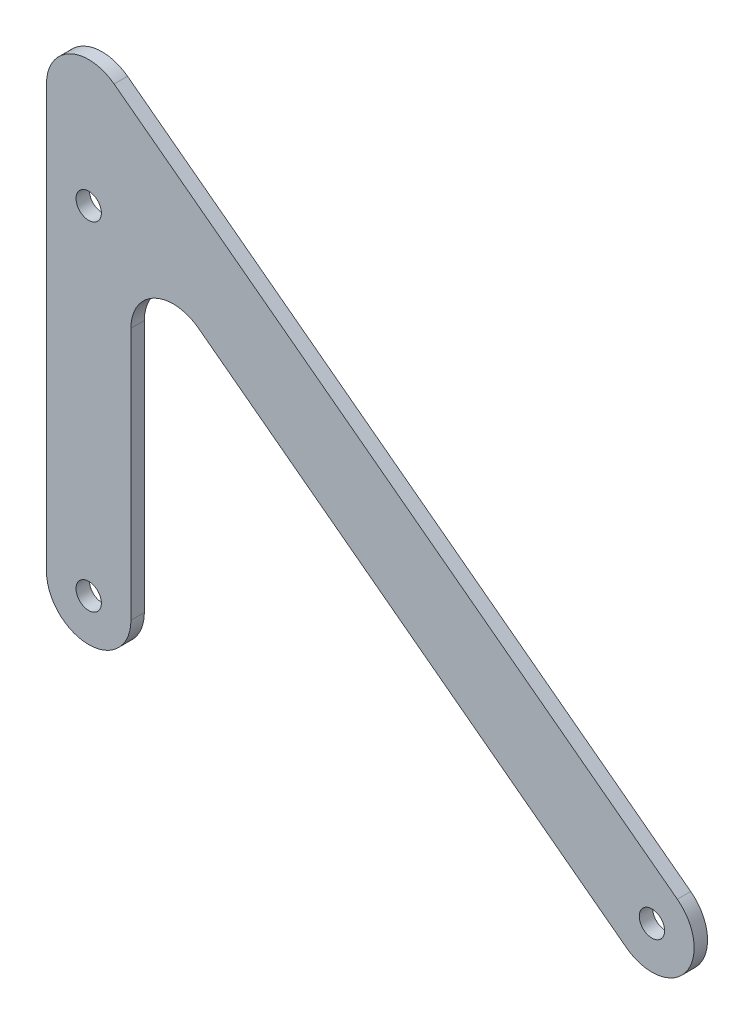
ISO-10303-21;
HEADER;
FILE_DESCRIPTION(('STEP AP214'),'2;1');
FILE_NAME('part.step','',(''),(''),'','','');
FILE_SCHEMA(('AUTOMOTIVE_DESIGN { 1 0 10303 214 1 1 1 1 }'));
ENDSEC;
DATA;
#1=APPLICATION_CONTEXT('core data for automotive mechanical design processes');
#2=APPLICATION_PROTOCOL_DEFINITION('international standard','automotive_design',2000,#1);
#3=PRODUCT_CONTEXT('',#1,'mechanical');
#4=PRODUCT('Part','Part','',(#3));
#5=PRODUCT_RELATED_PRODUCT_CATEGORY('part','',(#4));
#6=PRODUCT_DEFINITION_FORMATION('','',#4);
#7=PRODUCT_DEFINITION_CONTEXT('part definition',#1,'design');
#8=PRODUCT_DEFINITION('design','',#6,#7);
#9=PRODUCT_DEFINITION_SHAPE('','',#8);
#10=(LENGTH_UNIT() NAMED_UNIT(*) SI_UNIT(.MILLI.,.METRE.));
#11=(NAMED_UNIT(*) PLANE_ANGLE_UNIT() SI_UNIT($,.RADIAN.));
#12=(NAMED_UNIT(*) SI_UNIT($,.STERADIAN.) SOLID_ANGLE_UNIT());
#13=UNCERTAINTY_MEASURE_WITH_UNIT(LENGTH_MEASURE(1.E-05),#10,'distance_accuracy_value','');
#14=(GEOMETRIC_REPRESENTATION_CONTEXT(3) GLOBAL_UNCERTAINTY_ASSIGNED_CONTEXT((#13)) GLOBAL_UNIT_ASSIGNED_CONTEXT((#10,
#11,#12)) REPRESENTATION_CONTEXT('',''));
#15=CARTESIAN_POINT('',(0.,0.,0.));
#16=DIRECTION('',(0.,0.,1.));
#17=DIRECTION('',(1.,0.,0.));
#18=AXIS2_PLACEMENT_3D('',#15,#16,#17);
#19=CARTESIAN_POINT('',(0.,0.,3.175));
#20=DIRECTION('',(0.,0.,-1.));
#21=DIRECTION('',(-1.,0.,0.));
#22=AXIS2_PLACEMENT_3D('',#19,#20,#21);
#23=PLANE('',#22);
#24=CARTESIAN_POINT('',(0.,80.,3.175));
#25=DIRECTION('',(0.,0.,1.));
#26=DIRECTION('',(1.,0.,0.));
#27=AXIS2_PLACEMENT_3D('',#24,#25,#26);
#28=CIRCLE('',#27,3.);
#29=CARTESIAN_POINT('',(3.,80.,3.175));
#30=VERTEX_POINT('',#29);
#31=EDGE_CURVE('E223',#30,#30,#28,.T.);
#32=ORIENTED_EDGE('',*,*,#31,.F.);
#33=EDGE_LOOP('',(#32));
#34=FACE_BOUND('',#33,.T.);
#35=DIRECTION('',(-0.79863551004729,0.601815023152052,0.));
#36=VECTOR('',#35,1.);
#37=CARTESIAN_POINT('',(-10.,120.05689708259,3.175));
#38=LINE('',#37,#36);
#39=CARTESIAN_POINT('',(139.390280409418,7.48324623408012,3.175));
#40=VERTEX_POINT('',#39);
#41=CARTESIAN_POINT('',(6.01815023152051,107.986355100473,3.175));
#42=VERTEX_POINT('',#41);
#43=EDGE_CURVE('E164',#40,#42,#38,.T.);
#44=ORIENTED_EDGE('',*,*,#43,.T.);
#45=CARTESIAN_POINT('',(0.,100.,3.175));
#46=DIRECTION('',(0.,0.,-1.));
#47=DIRECTION('',(-1.,0.,0.));
#48=AXIS2_PLACEMENT_3D('',#45,#46,#47);
#49=CIRCLE('',#48,10.);
#50=CARTESIAN_POINT('',(-10.,100.,3.175));
#51=VERTEX_POINT('',#50);
#52=EDGE_CURVE('E146',#42,#51,#49,.F.);
#53=ORIENTED_EDGE('',*,*,#52,.T.);
#54=DIRECTION('',(0.,-1.,0.));
#55=VECTOR('',#54,1.);
#56=CARTESIAN_POINT('',(-10.,0.,3.175));
#57=LINE('',#56,#55);
#58=CARTESIAN_POINT('',(-10.,0.,3.175));
#59=VERTEX_POINT('',#58);
#60=EDGE_CURVE('E121',#51,#59,#57,.T.);
#61=ORIENTED_EDGE('',*,*,#60,.T.);
#62=CARTESIAN_POINT('',(0.,0.,3.175));
#63=DIRECTION('',(0.,0.,1.));
#64=DIRECTION('',(-1.,0.,0.));
#65=AXIS2_PLACEMENT_3D('',#62,#63,#64);
#66=CIRCLE('',#65,10.);
#67=CARTESIAN_POINT('',(10.,0.,3.175));
#68=VERTEX_POINT('',#67);
#69=EDGE_CURVE('E116',#59,#68,#66,.T.);
#70=ORIENTED_EDGE('',*,*,#69,.T.);
#71=DIRECTION('',(0.,1.,0.));
#72=VECTOR('',#71,1.);
#73=CARTESIAN_POINT('',(10.,0.,3.175));
#74=LINE('',#73,#72);
#75=CARTESIAN_POINT('',(10.,59.8862058348193,3.175));
#76=VERTEX_POINT('',#75);
#77=EDGE_CURVE('E104',#68,#76,#74,.T.);
#78=ORIENTED_EDGE('',*,*,#77,.T.);
#79=CARTESIAN_POINT('',(20.,59.8862058348194,3.175));
#80=DIRECTION('',(0.,0.,-1.));
#81=DIRECTION('',(-1.,0.,0.));
#82=AXIS2_PLACEMENT_3D('',#79,#80,#81);
#83=CIRCLE('',#82,10.);
#84=CARTESIAN_POINT('',(26.0181502315205,67.8725609352922,3.175));
#85=VERTEX_POINT('',#84);
#86=EDGE_CURVE('E11',#76,#85,#83,.T.);
#87=ORIENTED_EDGE('',*,*,#86,.T.);
#88=DIRECTION('',(0.79863551004729,-0.601815023152052,0.));
#89=VECTOR('',#88,1.);
#90=CARTESIAN_POINT('',(10.,79.9431029174097,3.175));
#91=LINE('',#90,#89);
#92=CARTESIAN_POINT('',(127.353979946377,-8.48946396686568,3.175));
#93=VERTEX_POINT('',#92);
#94=EDGE_CURVE('E115',#85,#93,#91,.T.);
#95=ORIENTED_EDGE('',*,*,#94,.T.);
#96=CARTESIAN_POINT('',(133.372130177897,-0.503108866392774,3.175));
#97=DIRECTION('',(0.,0.,1.));
#98=DIRECTION('',(-1.,0.,0.));
#99=AXIS2_PLACEMENT_3D('',#96,#97,#98);
#100=CIRCLE('',#99,10.);
#101=EDGE_CURVE('E162',#93,#40,#100,.T.);
#102=ORIENTED_EDGE('',*,*,#101,.T.);
#103=EDGE_LOOP('',(#44,#53,#61,#70,#78,#87,#95,#102));
#104=FACE_BOUND('',#103,.T.);
#105=CARTESIAN_POINT('',(0.,0.,3.175));
#106=DIRECTION('',(0.,0.,1.));
#107=DIRECTION('',(1.,0.,0.));
#108=AXIS2_PLACEMENT_3D('',#105,#106,#107);
#109=CIRCLE('',#108,3.);
#110=CARTESIAN_POINT('',(3.,0.,3.175));
#111=VERTEX_POINT('',#110);
#112=EDGE_CURVE('E170',#111,#111,#109,.T.);
#113=ORIENTED_EDGE('',*,*,#112,.F.);
#114=EDGE_LOOP('',(#113));
#115=FACE_BOUND('',#114,.T.);
#116=CARTESIAN_POINT('',(133.372130177897,-0.503108866392774,3.175));
#117=DIRECTION('',(0.,0.,1.));
#118=DIRECTION('',(1.,0.,0.));
#119=AXIS2_PLACEMENT_3D('',#116,#117,#118);
#120=CIRCLE('',#119,2.99999999999999);
#121=CARTESIAN_POINT('',(136.372130177897,-0.503108866392774,3.175));
#122=VERTEX_POINT('',#121);
#123=EDGE_CURVE('E228',#122,#122,#120,.T.);
#124=ORIENTED_EDGE('',*,*,#123,.F.);
#125=EDGE_LOOP('',(#124));
#126=FACE_BOUND('',#125,.T.);
#127=ADVANCED_FACE('F38',(#34,#104,#115,#126),#23,.F.);
#128=CARTESIAN_POINT('',(0.,0.,0.));
#129=DIRECTION('',(0.,0.,-1.));
#130=DIRECTION('',(-1.,0.,0.));
#131=AXIS2_PLACEMENT_3D('',#128,#129,#130);
#132=PLANE('',#131);
#133=CARTESIAN_POINT('',(0.,80.,0.));
#134=DIRECTION('',(0.,0.,1.));
#135=DIRECTION('',(1.,0.,0.));
#136=AXIS2_PLACEMENT_3D('',#133,#134,#135);
#137=CIRCLE('',#136,3.);
#138=CARTESIAN_POINT('',(3.,80.,0.));
#139=VERTEX_POINT('',#138);
#140=EDGE_CURVE('E221',#139,#139,#137,.T.);
#141=ORIENTED_EDGE('',*,*,#140,.T.);
#142=EDGE_LOOP('',(#141));
#143=FACE_BOUND('',#142,.T.);
#144=CARTESIAN_POINT('',(0.,0.,0.));
#145=DIRECTION('',(0.,0.,1.));
#146=DIRECTION('',(1.,0.,0.));
#147=AXIS2_PLACEMENT_3D('',#144,#145,#146);
#148=CIRCLE('',#147,3.);
#149=CARTESIAN_POINT('',(3.,0.,0.));
#150=VERTEX_POINT('',#149);
#151=EDGE_CURVE('E231',#150,#150,#148,.T.);
#152=ORIENTED_EDGE('',*,*,#151,.T.);
#153=EDGE_LOOP('',(#152));
#154=FACE_BOUND('',#153,.T.);
#155=DIRECTION('',(0.,-1.,0.));
#156=VECTOR('',#155,1.);
#157=CARTESIAN_POINT('',(-10.,0.,0.));
#158=LINE('',#157,#156);
#159=CARTESIAN_POINT('',(-10.,100.,0.));
#160=VERTEX_POINT('',#159);
#161=CARTESIAN_POINT('',(-10.,0.,0.));
#162=VERTEX_POINT('',#161);
#163=EDGE_CURVE('E125',#160,#162,#158,.T.);
#164=ORIENTED_EDGE('',*,*,#163,.F.);
#165=CARTESIAN_POINT('',(0.,100.,0.));
#166=DIRECTION('',(0.,0.,-1.));
#167=DIRECTION('',(-1.,0.,0.));
#168=AXIS2_PLACEMENT_3D('',#165,#166,#167);
#169=CIRCLE('',#168,10.);
#170=CARTESIAN_POINT('',(6.01815023152051,107.986355100473,0.));
#171=VERTEX_POINT('',#170);
#172=EDGE_CURVE('E61',#160,#171,#169,.T.);
#173=ORIENTED_EDGE('',*,*,#172,.T.);
#174=DIRECTION('',(-0.79863551004729,0.601815023152052,0.));
#175=VECTOR('',#174,1.);
#176=CARTESIAN_POINT('',(-10.,120.05689708259,0.));
#177=LINE('',#176,#175);
#178=CARTESIAN_POINT('',(139.390280409418,7.48324623408012,0.));
#179=VERTEX_POINT('',#178);
#180=EDGE_CURVE('E175',#179,#171,#177,.T.);
#181=ORIENTED_EDGE('',*,*,#180,.F.);
#182=CARTESIAN_POINT('',(133.372130177897,-0.503108866392774,0.));
#183=DIRECTION('',(0.,0.,1.));
#184=DIRECTION('',(-1.,0.,0.));
#185=AXIS2_PLACEMENT_3D('',#182,#183,#184);
#186=CIRCLE('',#185,10.);
#187=CARTESIAN_POINT('',(127.353979946377,-8.48946396686568,0.));
#188=VERTEX_POINT('',#187);
#189=EDGE_CURVE('E173',#188,#179,#186,.T.);
#190=ORIENTED_EDGE('',*,*,#189,.F.);
#191=DIRECTION('',(0.79863551004729,-0.601815023152052,0.));
#192=VECTOR('',#191,1.);
#193=CARTESIAN_POINT('',(10.,79.9431029174097,0.));
#194=LINE('',#193,#192);
#195=CARTESIAN_POINT('',(26.0181502315205,67.8725609352922,0.));
#196=VERTEX_POINT('',#195);
#197=EDGE_CURVE('E152',#196,#188,#194,.T.);
#198=ORIENTED_EDGE('',*,*,#197,.F.);
#199=CARTESIAN_POINT('',(20.,59.8862058348194,0.));
#200=DIRECTION('',(0.,0.,-1.));
#201=DIRECTION('',(-1.,0.,0.));
#202=AXIS2_PLACEMENT_3D('',#199,#200,#201);
#203=CIRCLE('',#202,10.);
#204=CARTESIAN_POINT('',(10.,59.8862058348193,0.));
#205=VERTEX_POINT('',#204);
#206=EDGE_CURVE('E46',#196,#205,#203,.F.);
#207=ORIENTED_EDGE('',*,*,#206,.T.);
#208=DIRECTION('',(0.,1.,0.));
#209=VECTOR('',#208,1.);
#210=CARTESIAN_POINT('',(10.,0.,0.));
#211=LINE('',#210,#209);
#212=CARTESIAN_POINT('',(10.,0.,0.));
#213=VERTEX_POINT('',#212);
#214=EDGE_CURVE('E150',#213,#205,#211,.T.);
#215=ORIENTED_EDGE('',*,*,#214,.F.);
#216=CARTESIAN_POINT('',(0.,0.,0.));
#217=DIRECTION('',(0.,0.,1.));
#218=DIRECTION('',(-1.,0.,0.));
#219=AXIS2_PLACEMENT_3D('',#216,#217,#218);
#220=CIRCLE('',#219,10.);
#221=EDGE_CURVE('E129',#162,#213,#220,.T.);
#222=ORIENTED_EDGE('',*,*,#221,.F.);
#223=EDGE_LOOP('',(#164,#173,#181,#190,#198,#207,#215,#222));
#224=FACE_BOUND('',#223,.T.);
#225=CARTESIAN_POINT('',(133.372130177897,-0.503108866392774,0.));
#226=DIRECTION('',(0.,0.,1.));
#227=DIRECTION('',(1.,0.,0.));
#228=AXIS2_PLACEMENT_3D('',#225,#226,#227);
#229=CIRCLE('',#228,2.99999999999999);
#230=CARTESIAN_POINT('',(136.372130177897,-0.503108866392774,0.));
#231=VERTEX_POINT('',#230);
#232=EDGE_CURVE('E225',#231,#231,#229,.T.);
#233=ORIENTED_EDGE('',*,*,#232,.T.);
#234=EDGE_LOOP('',(#233));
#235=FACE_BOUND('',#234,.T.);
#236=ADVANCED_FACE('F148',(#143,#154,#224,#235),#132,.T.);
#237=CARTESIAN_POINT('',(0.,0.,3.175));
#238=DIRECTION('',(0.,0.,-1.));
#239=DIRECTION('',(-1.,0.,0.));
#240=AXIS2_PLACEMENT_3D('',#237,#238,#239);
#241=CYLINDRICAL_SURFACE('',#240,10.);
#242=ORIENTED_EDGE('',*,*,#221,.T.);
#243=DIRECTION('',(0.,0.,-1.));
#244=VECTOR('',#243,1.);
#245=CARTESIAN_POINT('',(10.,0.,3.175));
#246=LINE('',#245,#244);
#247=EDGE_CURVE('E109',#68,#213,#246,.T.);
#248=ORIENTED_EDGE('',*,*,#247,.F.);
#249=ORIENTED_EDGE('',*,*,#69,.F.);
#250=DIRECTION('',(0.,0.,-1.));
#251=VECTOR('',#250,1.);
#252=CARTESIAN_POINT('',(-10.,0.,3.175));
#253=LINE('',#252,#251);
#254=EDGE_CURVE('E169',#59,#162,#253,.T.);
#255=ORIENTED_EDGE('',*,*,#254,.T.);
#256=EDGE_LOOP('',(#242,#248,#249,#255));
#257=FACE_BOUND('',#256,.T.);
#258=ADVANCED_FACE('F127',(#257),#241,.T.);
#259=CARTESIAN_POINT('',(10.,0.,3.175));
#260=DIRECTION('',(-1.,0.,0.));
#261=DIRECTION('',(0.,-1.,0.));
#262=AXIS2_PLACEMENT_3D('',#259,#260,#261);
#263=PLANE('',#262);
#264=ORIENTED_EDGE('',*,*,#214,.T.);
#265=DIRECTION('',(0.,0.,-1.));
#266=VECTOR('',#265,1.);
#267=CARTESIAN_POINT('',(10.,59.8862058348194,3.175));
#268=LINE('',#267,#266);
#269=EDGE_CURVE('E112',#205,#76,#268,.F.);
#270=ORIENTED_EDGE('',*,*,#269,.T.);
#271=ORIENTED_EDGE('',*,*,#77,.F.);
#272=ORIENTED_EDGE('',*,*,#247,.T.);
#273=EDGE_LOOP('',(#264,#270,#271,#272));
#274=FACE_BOUND('',#273,.T.);
#275=ADVANCED_FACE('F107',(#274),#263,.F.);
#276=CARTESIAN_POINT('',(10.,79.9431029174097,3.175));
#277=DIRECTION('',(0.601815023152052,0.79863551004729,0.));
#278=DIRECTION('',(-0.79863551004729,0.601815023152052,0.));
#279=AXIS2_PLACEMENT_3D('',#276,#277,#278);
#280=PLANE('',#279);
#281=ORIENTED_EDGE('',*,*,#94,.F.);
#282=DIRECTION('',(0.,0.,-1.));
#283=VECTOR('',#282,1.);
#284=CARTESIAN_POINT('',(26.0181502315205,67.8725609352922,0.));
#285=LINE('',#284,#283);
#286=EDGE_CURVE('E130',#85,#196,#285,.T.);
#287=ORIENTED_EDGE('',*,*,#286,.T.);
#288=ORIENTED_EDGE('',*,*,#197,.T.);
#289=DIRECTION('',(0.,0.,-1.));
#290=VECTOR('',#289,1.);
#291=CARTESIAN_POINT('',(127.353979946377,-8.48946396686568,3.175));
#292=LINE('',#291,#290);
#293=EDGE_CURVE('E131',#93,#188,#292,.T.);
#294=ORIENTED_EDGE('',*,*,#293,.F.);
#295=EDGE_LOOP('',(#281,#287,#288,#294));
#296=FACE_BOUND('',#295,.T.);
#297=ADVANCED_FACE('F160',(#296),#280,.F.);
#298=CARTESIAN_POINT('',(133.372130177897,-0.503108866392774,3.175));
#299=DIRECTION('',(0.,0.,-1.));
#300=DIRECTION('',(-1.,0.,0.));
#301=AXIS2_PLACEMENT_3D('',#298,#299,#300);
#302=CYLINDRICAL_SURFACE('',#301,10.);
#303=ORIENTED_EDGE('',*,*,#189,.T.);
#304=DIRECTION('',(0.,0.,-1.));
#305=VECTOR('',#304,1.);
#306=CARTESIAN_POINT('',(139.390280409418,7.48324623408012,3.175));
#307=LINE('',#306,#305);
#308=EDGE_CURVE('E136',#40,#179,#307,.T.);
#309=ORIENTED_EDGE('',*,*,#308,.F.);
#310=ORIENTED_EDGE('',*,*,#101,.F.);
#311=ORIENTED_EDGE('',*,*,#293,.T.);
#312=EDGE_LOOP('',(#303,#309,#310,#311));
#313=FACE_BOUND('',#312,.T.);
#314=ADVANCED_FACE('F182',(#313),#302,.T.);
#315=CARTESIAN_POINT('',(-10.,120.05689708259,3.175));
#316=DIRECTION('',(-0.601815023152052,-0.79863551004729,0.));
#317=DIRECTION('',(0.79863551004729,-0.601815023152052,0.));
#318=AXIS2_PLACEMENT_3D('',#315,#316,#317);
#319=PLANE('',#318);
#320=ORIENTED_EDGE('',*,*,#180,.T.);
#321=DIRECTION('',(0.,0.,-1.));
#322=VECTOR('',#321,1.);
#323=CARTESIAN_POINT('',(6.01815023152051,107.986355100473,3.175));
#324=LINE('',#323,#322);
#325=EDGE_CURVE('E53',#171,#42,#324,.F.);
#326=ORIENTED_EDGE('',*,*,#325,.T.);
#327=ORIENTED_EDGE('',*,*,#43,.F.);
#328=ORIENTED_EDGE('',*,*,#308,.T.);
#329=EDGE_LOOP('',(#320,#326,#327,#328));
#330=FACE_BOUND('',#329,.T.);
#331=ADVANCED_FACE('F180',(#330),#319,.F.);
#332=CARTESIAN_POINT('',(-10.,0.,3.175));
#333=DIRECTION('',(1.,0.,0.));
#334=DIRECTION('',(0.,1.,0.));
#335=AXIS2_PLACEMENT_3D('',#332,#333,#334);
#336=PLANE('',#335);
#337=ORIENTED_EDGE('',*,*,#60,.F.);
#338=DIRECTION('',(0.,0.,-1.));
#339=VECTOR('',#338,1.);
#340=CARTESIAN_POINT('',(-10.,100.,3.175));
#341=LINE('',#340,#339);
#342=EDGE_CURVE('E141',#51,#160,#341,.T.);
#343=ORIENTED_EDGE('',*,*,#342,.T.);
#344=ORIENTED_EDGE('',*,*,#163,.T.);
#345=ORIENTED_EDGE('',*,*,#254,.F.);
#346=EDGE_LOOP('',(#337,#343,#344,#345));
#347=FACE_BOUND('',#346,.T.);
#348=ADVANCED_FACE('F187',(#347),#336,.F.);
#349=CARTESIAN_POINT('',(0.,0.,3.175));
#350=DIRECTION('',(0.,0.,-1.));
#351=DIRECTION('',(-1.,0.,0.));
#352=AXIS2_PLACEMENT_3D('',#349,#350,#351);
#353=CYLINDRICAL_SURFACE('',#352,3.);
#354=ORIENTED_EDGE('',*,*,#112,.T.);
#355=EDGE_LOOP('',(#354));
#356=FACE_BOUND('',#355,.T.);
#357=ORIENTED_EDGE('',*,*,#151,.F.);
#358=EDGE_LOOP('',(#357));
#359=FACE_BOUND('',#358,.T.);
#360=ADVANCED_FACE('F189',(#356,#359),#353,.F.);
#361=CARTESIAN_POINT('',(133.372130177897,-0.503108866392774,3.175));
#362=DIRECTION('',(0.,0.,-1.));
#363=DIRECTION('',(-1.,0.,0.));
#364=AXIS2_PLACEMENT_3D('',#361,#362,#363);
#365=CYLINDRICAL_SURFACE('',#364,2.99999999999999);
#366=ORIENTED_EDGE('',*,*,#123,.T.);
#367=EDGE_LOOP('',(#366));
#368=FACE_BOUND('',#367,.T.);
#369=ORIENTED_EDGE('',*,*,#232,.F.);
#370=EDGE_LOOP('',(#369));
#371=FACE_BOUND('',#370,.T.);
#372=ADVANCED_FACE('F195',(#368,#371),#365,.F.);
#373=CARTESIAN_POINT('',(20.,59.8862058348194,3.175));
#374=DIRECTION('',(0.,0.,1.));
#375=DIRECTION('',(1.,0.,0.));
#376=AXIS2_PLACEMENT_3D('',#373,#374,#375);
#377=CYLINDRICAL_SURFACE('',#376,10.);
#378=ORIENTED_EDGE('',*,*,#86,.F.);
#379=ORIENTED_EDGE('',*,*,#269,.F.);
#380=ORIENTED_EDGE('',*,*,#206,.F.);
#381=ORIENTED_EDGE('',*,*,#286,.F.);
#382=EDGE_LOOP('',(#378,#379,#380,#381));
#383=FACE_BOUND('',#382,.T.);
#384=ADVANCED_FACE('F156',(#383),#377,.F.);
#385=CARTESIAN_POINT('',(0.,100.,3.175));
#386=DIRECTION('',(0.,0.,-1.));
#387=DIRECTION('',(-1.,0.,0.));
#388=AXIS2_PLACEMENT_3D('',#385,#386,#387);
#389=CYLINDRICAL_SURFACE('',#388,10.);
#390=ORIENTED_EDGE('',*,*,#52,.F.);
#391=ORIENTED_EDGE('',*,*,#325,.F.);
#392=ORIENTED_EDGE('',*,*,#172,.F.);
#393=ORIENTED_EDGE('',*,*,#342,.F.);
#394=EDGE_LOOP('',(#390,#391,#392,#393));
#395=FACE_BOUND('',#394,.T.);
#396=ADVANCED_FACE('F40',(#395),#389,.T.);
#397=CARTESIAN_POINT('',(0.,80.,0.));
#398=DIRECTION('',(0.,0.,1.));
#399=DIRECTION('',(1.,0.,0.));
#400=AXIS2_PLACEMENT_3D('',#397,#398,#399);
#401=CYLINDRICAL_SURFACE('',#400,3.);
#402=ORIENTED_EDGE('',*,*,#140,.F.);
#403=EDGE_LOOP('',(#402));
#404=FACE_BOUND('',#403,.T.);
#405=ORIENTED_EDGE('',*,*,#31,.T.);
#406=EDGE_LOOP('',(#405));
#407=FACE_BOUND('',#406,.T.);
#408=ADVANCED_FACE('F212',(#404,#407),#401,.F.);
#409=CLOSED_SHELL('',(#127,#236,#258,#275,#297,#314,#331,#348,#360,#372,#384,#396,#408));
#410=MANIFOLD_SOLID_BREP('B2',#409);
#411=ADVANCED_BREP_SHAPE_REPRESENTATION('',(#18,#410),#14);
#412=SHAPE_DEFINITION_REPRESENTATION(#9,#411);
ENDSEC;
END-ISO-10303-21;
